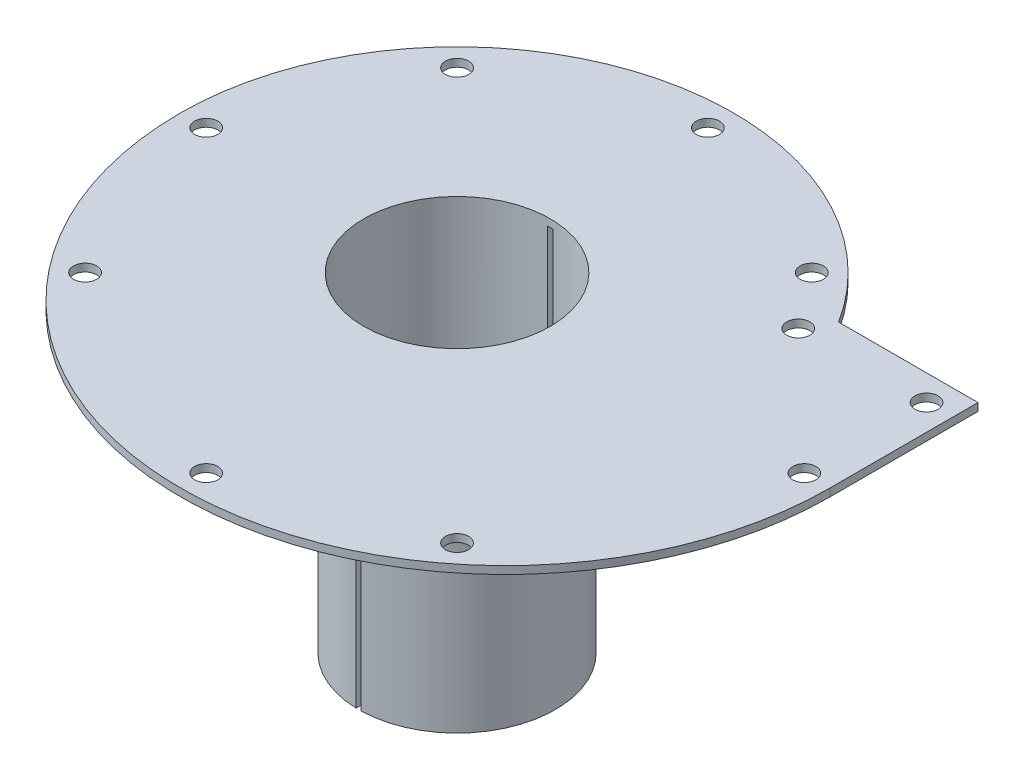
ISO-10303-21;
HEADER;
FILE_DESCRIPTION(('STEP AP214'),'2;1');
FILE_NAME('part.step','',(''),(''),'','','');
FILE_SCHEMA(('AUTOMOTIVE_DESIGN { 1 0 10303 214 1 1 1 1 }'));
ENDSEC;
DATA;
#1=APPLICATION_CONTEXT('core data for automotive mechanical design processes');
#2=APPLICATION_PROTOCOL_DEFINITION('international standard','automotive_design',2000,#1);
#3=PRODUCT_CONTEXT('',#1,'mechanical');
#4=PRODUCT('Part','Part','',(#3));
#5=PRODUCT_RELATED_PRODUCT_CATEGORY('part','',(#4));
#6=PRODUCT_DEFINITION_FORMATION('','',#4);
#7=PRODUCT_DEFINITION_CONTEXT('part definition',#1,'design');
#8=PRODUCT_DEFINITION('design','',#6,#7);
#9=PRODUCT_DEFINITION_SHAPE('','',#8);
#10=(LENGTH_UNIT() NAMED_UNIT(*) SI_UNIT(.MILLI.,.METRE.));
#11=(NAMED_UNIT(*) PLANE_ANGLE_UNIT() SI_UNIT($,.RADIAN.));
#12=(NAMED_UNIT(*) SI_UNIT($,.STERADIAN.) SOLID_ANGLE_UNIT());
#13=UNCERTAINTY_MEASURE_WITH_UNIT(LENGTH_MEASURE(1.E-05),#10,'distance_accuracy_value','');
#14=(GEOMETRIC_REPRESENTATION_CONTEXT(3) GLOBAL_UNCERTAINTY_ASSIGNED_CONTEXT((#13)) GLOBAL_UNIT_ASSIGNED_CONTEXT((#10,
#11,#12)) REPRESENTATION_CONTEXT('',''));
#15=CARTESIAN_POINT('',(0.,0.,0.));
#16=DIRECTION('',(0.,0.,1.));
#17=DIRECTION('',(1.,0.,0.));
#18=AXIS2_PLACEMENT_3D('',#15,#16,#17);
#19=CARTESIAN_POINT('',(0.,-50.,0.));
#20=DIRECTION('',(0.,1.,0.));
#21=DIRECTION('',(0.,0.,1.));
#22=AXIS2_PLACEMENT_3D('',#19,#20,#21);
#23=CYLINDRICAL_SURFACE('',#22,15.3);
#24=DIRECTION('',(0.,1.,0.));
#25=VECTOR('',#24,1.);
#26=CARTESIAN_POINT('',(0.4,-50.,-15.2947703480634));
#27=LINE('',#26,#25);
#28=CARTESIAN_POINT('',(0.4,0.,-15.2947703480634));
#29=VERTEX_POINT('',#28);
#30=CARTESIAN_POINT('',(0.4,-50.,-15.2947703480634));
#31=VERTEX_POINT('',#30);
#32=EDGE_CURVE('E130',#29,#31,#27,.F.);
#33=ORIENTED_EDGE('',*,*,#32,.F.);
#34=CARTESIAN_POINT('',(0.,0.,0.));
#35=DIRECTION('',(0.,1.,0.));
#36=DIRECTION('',(1.,0.,0.));
#37=AXIS2_PLACEMENT_3D('',#34,#35,#36);
#38=CIRCLE('',#37,15.3);
#39=CARTESIAN_POINT('',(0.4,0.,15.2947703480634));
#40=VERTEX_POINT('',#39);
#41=EDGE_CURVE('E158',#40,#29,#38,.T.);
#42=ORIENTED_EDGE('',*,*,#41,.F.);
#43=DIRECTION('',(0.,1.,0.));
#44=VECTOR('',#43,1.);
#45=CARTESIAN_POINT('',(0.4,-50.,15.2947703480634));
#46=LINE('',#45,#44);
#47=CARTESIAN_POINT('',(0.4,-50.,15.2947703480634));
#48=VERTEX_POINT('',#47);
#49=EDGE_CURVE('E139',#48,#40,#46,.T.);
#50=ORIENTED_EDGE('',*,*,#49,.F.);
#51=CARTESIAN_POINT('',(0.,-50.,0.));
#52=DIRECTION('',(0.,1.,0.));
#53=DIRECTION('',(1.,0.,0.));
#54=AXIS2_PLACEMENT_3D('',#51,#52,#53);
#55=CIRCLE('',#54,15.3);
#56=EDGE_CURVE('E146',#48,#31,#55,.T.);
#57=ORIENTED_EDGE('',*,*,#56,.T.);
#58=EDGE_LOOP('',(#33,#42,#50,#57));
#59=FACE_BOUND('',#58,.T.);
#60=ADVANCED_FACE('F43',(#59),#23,.T.);
#61=CARTESIAN_POINT('',(0.,-50.,0.));
#62=DIRECTION('',(0.,1.,0.));
#63=DIRECTION('',(0.,0.,1.));
#64=AXIS2_PLACEMENT_3D('',#61,#62,#63);
#65=PLANE('',#64);
#66=ORIENTED_EDGE('',*,*,#56,.F.);
#67=DIRECTION('',(0.,0.,1.));
#68=VECTOR('',#67,1.);
#69=CARTESIAN_POINT('',(0.4,-50.,17.5));
#70=LINE('',#69,#68);
#71=CARTESIAN_POINT('',(0.4,-50.,14.4944817085676));
#72=VERTEX_POINT('',#71);
#73=EDGE_CURVE('E150',#72,#48,#70,.T.);
#74=ORIENTED_EDGE('',*,*,#73,.F.);
#75=CARTESIAN_POINT('',(0.,-50.,0.));
#76=DIRECTION('',(0.,1.,0.));
#77=DIRECTION('',(0.,0.,1.));
#78=AXIS2_PLACEMENT_3D('',#75,#76,#77);
#79=CIRCLE('',#78,14.5);
#80=CARTESIAN_POINT('',(0.4,-50.,-14.4944817085676));
#81=VERTEX_POINT('',#80);
#82=EDGE_CURVE('E148',#72,#81,#79,.T.);
#83=ORIENTED_EDGE('',*,*,#82,.T.);
#84=EDGE_CURVE('E133',#31,#81,#70,.T.);
#85=ORIENTED_EDGE('',*,*,#84,.F.);
#86=EDGE_LOOP('',(#66,#74,#83,#85));
#87=FACE_BOUND('',#86,.T.);
#88=ADVANCED_FACE('F144',(#87),#65,.F.);
#89=CARTESIAN_POINT('',(0.,1.2,0.));
#90=DIRECTION('',(0.,1.,0.));
#91=DIRECTION('',(0.,0.,1.));
#92=AXIS2_PLACEMENT_3D('',#89,#90,#91);
#93=PLANE('',#92);
#94=CARTESIAN_POINT('',(27.5771644662549,1.2,-27.5771644662958));
#95=DIRECTION('',(0.,1.,0.));
#96=DIRECTION('',(0.,0.,1.));
#97=AXIS2_PLACEMENT_3D('',#94,#95,#96);
#98=CIRCLE('',#97,1.8);
#99=CARTESIAN_POINT('',(27.5771644662549,1.2,-25.7771644662958));
#100=VERTEX_POINT('',#99);
#101=EDGE_CURVE('E272',#100,#100,#98,.T.);
#102=ORIENTED_EDGE('',*,*,#101,.F.);
#103=EDGE_LOOP('',(#102));
#104=FACE_BOUND('',#103,.T.);
#105=CARTESIAN_POINT('',(-28.9159226105549,1.2,28.9159226105978));
#106=DIRECTION('',(0.,1.,0.));
#107=DIRECTION('',(0.,0.,1.));
#108=AXIS2_PLACEMENT_3D('',#105,#106,#107);
#109=CIRCLE('',#108,1.8);
#110=CARTESIAN_POINT('',(-28.9159226105549,1.2,30.7159226105978));
#111=VERTEX_POINT('',#110);
#112=EDGE_CURVE('E260',#111,#111,#109,.T.);
#113=ORIENTED_EDGE('',*,*,#112,.F.);
#114=EDGE_LOOP('',(#113));
#115=FACE_BOUND('',#114,.T.);
#116=CARTESIAN_POINT('',(-1.36167772214882E-13,1.2,-39.));
#117=DIRECTION('',(0.,1.,0.));
#118=DIRECTION('',(0.,0.,1.));
#119=AXIS2_PLACEMENT_3D('',#116,#117,#118);
#120=CIRCLE('',#119,1.8);
#121=CARTESIAN_POINT('',(-1.36167772214882E-13,1.2,-37.2));
#122=VERTEX_POINT('',#121);
#123=EDGE_CURVE('E248',#122,#122,#120,.T.);
#124=ORIENTED_EDGE('',*,*,#123,.F.);
#125=EDGE_LOOP('',(#124));
#126=FACE_BOUND('',#125,.T.);
#127=CARTESIAN_POINT('',(7.49999999999999,1.2,46.5));
#128=DIRECTION('',(0.,1.,0.));
#129=DIRECTION('',(0.,0.,1.));
#130=AXIS2_PLACEMENT_3D('',#127,#128,#129);
#131=CIRCLE('',#130,1.8);
#132=CARTESIAN_POINT('',(7.49999999999999,1.2,48.3));
#133=VERTEX_POINT('',#132);
#134=EDGE_CURVE('E236',#133,#133,#131,.T.);
#135=ORIENTED_EDGE('',*,*,#134,.F.);
#136=EDGE_LOOP('',(#135));
#137=FACE_BOUND('',#136,.T.);
#138=CARTESIAN_POINT('',(54.,1.2,-19.));
#139=DIRECTION('',(0.,1.,0.));
#140=DIRECTION('',(0.,0.,1.));
#141=AXIS2_PLACEMENT_3D('',#138,#139,#140);
#142=CIRCLE('',#141,1.8);
#143=CARTESIAN_POINT('',(54.,1.2,-17.2));
#144=VERTEX_POINT('',#143);
#145=EDGE_CURVE('E224',#144,#144,#142,.T.);
#146=ORIENTED_EDGE('',*,*,#145,.F.);
#147=EDGE_LOOP('',(#146));
#148=FACE_BOUND('',#147,.T.);
#149=CARTESIAN_POINT('',(0.,1.2,0.));
#150=DIRECTION('',(0.,1.,0.));
#151=DIRECTION('',(0.,0.,1.));
#152=AXIS2_PLACEMENT_3D('',#149,#150,#151);
#153=CIRCLE('',#152,43.);
#154=CARTESIAN_POINT('',(36.3318042491699,1.2,-23.));
#155=VERTEX_POINT('',#154);
#156=CARTESIAN_POINT('',(-43.,1.2,0.));
#157=VERTEX_POINT('',#156);
#158=EDGE_CURVE('E206',#155,#157,#153,.T.);
#159=ORIENTED_EDGE('',*,*,#158,.T.);
#160=CARTESIAN_POINT('',(7.5,1.2,0.));
#161=DIRECTION('',(0.,1.,0.));
#162=DIRECTION('',(0.,0.,-1.));
#163=AXIS2_PLACEMENT_3D('',#160,#161,#162);
#164=CIRCLE('',#163,50.5);
#165=CARTESIAN_POINT('',(58.,1.2,0.));
#166=VERTEX_POINT('',#165);
#167=EDGE_CURVE('E217',#157,#166,#164,.T.);
#168=ORIENTED_EDGE('',*,*,#167,.T.);
#169=DIRECTION('',(0.,0.,-1.));
#170=VECTOR('',#169,1.);
#171=CARTESIAN_POINT('',(58.,1.2,-23.));
#172=LINE('',#171,#170);
#173=CARTESIAN_POINT('',(58.,1.2,-23.));
#174=VERTEX_POINT('',#173);
#175=EDGE_CURVE('E215',#166,#174,#172,.T.);
#176=ORIENTED_EDGE('',*,*,#175,.T.);
#177=DIRECTION('',(-1.,0.,0.));
#178=VECTOR('',#177,1.);
#179=CARTESIAN_POINT('',(36.3318042491699,1.2,-23.));
#180=LINE('',#179,#178);
#181=EDGE_CURVE('E203',#174,#155,#180,.T.);
#182=ORIENTED_EDGE('',*,*,#181,.T.);
#183=EDGE_LOOP('',(#159,#168,#176,#182));
#184=FACE_BOUND('',#183,.T.);
#185=CARTESIAN_POINT('',(34.0587727318528,1.2,-19.));
#186=DIRECTION('',(0.,1.,0.));
#187=DIRECTION('',(0.,0.,1.));
#188=AXIS2_PLACEMENT_3D('',#185,#186,#187);
#189=CIRCLE('',#188,1.8);
#190=CARTESIAN_POINT('',(34.0587727318528,1.2,-17.2));
#191=VERTEX_POINT('',#190);
#192=EDGE_CURVE('E213',#191,#191,#189,.T.);
#193=ORIENTED_EDGE('',*,*,#192,.F.);
#194=EDGE_LOOP('',(#193));
#195=FACE_BOUND('',#194,.T.);
#196=CARTESIAN_POINT('',(54.,1.2,0.));
#197=DIRECTION('',(0.,1.,0.));
#198=DIRECTION('',(0.,0.,1.));
#199=AXIS2_PLACEMENT_3D('',#196,#197,#198);
#200=CIRCLE('',#199,1.79999999999999);
#201=CARTESIAN_POINT('',(54.,1.2,1.79999999999999));
#202=VERTEX_POINT('',#201);
#203=EDGE_CURVE('E230',#202,#202,#200,.T.);
#204=ORIENTED_EDGE('',*,*,#203,.F.);
#205=EDGE_LOOP('',(#204));
#206=FACE_BOUND('',#205,.T.);
#207=CARTESIAN_POINT('',(-39.,1.2,0.));
#208=DIRECTION('',(0.,1.,0.));
#209=DIRECTION('',(0.,0.,1.));
#210=AXIS2_PLACEMENT_3D('',#207,#208,#209);
#211=CIRCLE('',#210,1.8);
#212=CARTESIAN_POINT('',(-39.,1.2,1.8));
#213=VERTEX_POINT('',#212);
#214=EDGE_CURVE('E242',#213,#213,#211,.T.);
#215=ORIENTED_EDGE('',*,*,#214,.F.);
#216=EDGE_LOOP('',(#215));
#217=FACE_BOUND('',#216,.T.);
#218=CARTESIAN_POINT('',(36.415922610604,1.2,36.4159226105499));
#219=DIRECTION('',(0.,1.,0.));
#220=DIRECTION('',(0.,0.,1.));
#221=AXIS2_PLACEMENT_3D('',#218,#219,#220);
#222=CIRCLE('',#221,1.79999999996534);
#223=CARTESIAN_POINT('',(36.415922610604,1.2,38.2159226105153));
#224=VERTEX_POINT('',#223);
#225=EDGE_CURVE('E254',#224,#224,#222,.T.);
#226=ORIENTED_EDGE('',*,*,#225,.F.);
#227=EDGE_LOOP('',(#226));
#228=FACE_BOUND('',#227,.T.);
#229=CARTESIAN_POINT('',(-27.5771644662958,1.2,-27.5771644662549));
#230=DIRECTION('',(0.,1.,0.));
#231=DIRECTION('',(0.,0.,1.));
#232=AXIS2_PLACEMENT_3D('',#229,#230,#231);
#233=CIRCLE('',#232,1.8);
#234=CARTESIAN_POINT('',(-27.5771644662958,1.2,-25.7771644662549));
#235=VERTEX_POINT('',#234);
#236=EDGE_CURVE('E266',#235,#235,#233,.T.);
#237=ORIENTED_EDGE('',*,*,#236,.F.);
#238=EDGE_LOOP('',(#237));
#239=FACE_BOUND('',#238,.T.);
#240=CARTESIAN_POINT('',(0.,1.2,0.));
#241=DIRECTION('',(0.,1.,0.));
#242=DIRECTION('',(0.,0.,1.));
#243=AXIS2_PLACEMENT_3D('',#240,#241,#242);
#244=CIRCLE('',#243,14.5);
#245=CARTESIAN_POINT('',(0.,1.2,14.5));
#246=VERTEX_POINT('',#245);
#247=EDGE_CURVE('E138',#246,#246,#244,.T.);
#248=ORIENTED_EDGE('',*,*,#247,.F.);
#249=EDGE_LOOP('',(#248));
#250=FACE_BOUND('',#249,.T.);
#251=ADVANCED_FACE('F313',(#104,#115,#126,#137,#148,#184,#195,#206,#217,#228,#239,#250),#93,.T.);
#252=CARTESIAN_POINT('',(0.,0.,0.));
#253=DIRECTION('',(0.,1.,0.));
#254=DIRECTION('',(0.,0.,1.));
#255=AXIS2_PLACEMENT_3D('',#252,#253,#254);
#256=PLANE('',#255);
#257=DIRECTION('',(0.,0.,-1.));
#258=VECTOR('',#257,1.);
#259=CARTESIAN_POINT('',(0.4,0.,17.5));
#260=LINE('',#259,#258);
#261=CARTESIAN_POINT('',(0.4,0.,14.4944817085676));
#262=VERTEX_POINT('',#261);
#263=EDGE_CURVE('E177',#40,#262,#260,.T.);
#264=ORIENTED_EDGE('',*,*,#263,.F.);
#265=ORIENTED_EDGE('',*,*,#41,.T.);
#266=CARTESIAN_POINT('',(0.4,0.,-14.4944817085676));
#267=VERTEX_POINT('',#266);
#268=EDGE_CURVE('E65',#267,#29,#260,.T.);
#269=ORIENTED_EDGE('',*,*,#268,.F.);
#270=CARTESIAN_POINT('',(0.,0.,0.));
#271=DIRECTION('',(0.,-1.,0.));
#272=DIRECTION('',(0.,0.,-1.));
#273=AXIS2_PLACEMENT_3D('',#270,#271,#272);
#274=CIRCLE('',#273,14.5);
#275=CARTESIAN_POINT('',(-0.4,0.,-14.4944817085676));
#276=VERTEX_POINT('',#275);
#277=EDGE_CURVE('E157',#267,#276,#274,.F.);
#278=ORIENTED_EDGE('',*,*,#277,.T.);
#279=DIRECTION('',(0.,0.,1.));
#280=VECTOR('',#279,1.);
#281=CARTESIAN_POINT('',(-0.4,0.,17.5));
#282=LINE('',#281,#280);
#283=CARTESIAN_POINT('',(-0.4,0.,-15.2947703480634));
#284=VERTEX_POINT('',#283);
#285=EDGE_CURVE('E286',#284,#276,#282,.T.);
#286=ORIENTED_EDGE('',*,*,#285,.F.);
#287=CARTESIAN_POINT('',(-0.4,0.,15.2947703480634));
#288=VERTEX_POINT('',#287);
#289=EDGE_CURVE('E154',#284,#288,#38,.T.);
#290=ORIENTED_EDGE('',*,*,#289,.T.);
#291=CARTESIAN_POINT('',(-0.4,0.,14.4944817085676));
#292=VERTEX_POINT('',#291);
#293=EDGE_CURVE('E58',#292,#288,#282,.T.);
#294=ORIENTED_EDGE('',*,*,#293,.F.);
#295=EDGE_CURVE('E165',#292,#262,#274,.F.);
#296=ORIENTED_EDGE('',*,*,#295,.T.);
#297=EDGE_LOOP('',(#264,#265,#269,#278,#286,#290,#294,#296));
#298=FACE_BOUND('',#297,.T.);
#299=CARTESIAN_POINT('',(-27.5771644662958,0.,-27.5771644662549));
#300=DIRECTION('',(0.,1.,0.));
#301=DIRECTION('',(0.,0.,1.));
#302=AXIS2_PLACEMENT_3D('',#299,#300,#301);
#303=CIRCLE('',#302,1.8);
#304=CARTESIAN_POINT('',(-27.5771644662958,0.,-25.7771644662549));
#305=VERTEX_POINT('',#304);
#306=EDGE_CURVE('E269',#305,#305,#303,.T.);
#307=ORIENTED_EDGE('',*,*,#306,.T.);
#308=EDGE_LOOP('',(#307));
#309=FACE_BOUND('',#308,.T.);
#310=CARTESIAN_POINT('',(36.415922610604,0.,36.4159226105499));
#311=DIRECTION('',(0.,1.,0.));
#312=DIRECTION('',(0.,0.,1.));
#313=AXIS2_PLACEMENT_3D('',#310,#311,#312);
#314=CIRCLE('',#313,1.79999999996534);
#315=CARTESIAN_POINT('',(36.415922610604,0.,38.2159226105153));
#316=VERTEX_POINT('',#315);
#317=EDGE_CURVE('E257',#316,#316,#314,.T.);
#318=ORIENTED_EDGE('',*,*,#317,.T.);
#319=EDGE_LOOP('',(#318));
#320=FACE_BOUND('',#319,.T.);
#321=CARTESIAN_POINT('',(-39.,0.,0.));
#322=DIRECTION('',(0.,1.,0.));
#323=DIRECTION('',(0.,0.,1.));
#324=AXIS2_PLACEMENT_3D('',#321,#322,#323);
#325=CIRCLE('',#324,1.8);
#326=CARTESIAN_POINT('',(-39.,0.,1.8));
#327=VERTEX_POINT('',#326);
#328=EDGE_CURVE('E245',#327,#327,#325,.T.);
#329=ORIENTED_EDGE('',*,*,#328,.T.);
#330=EDGE_LOOP('',(#329));
#331=FACE_BOUND('',#330,.T.);
#332=CARTESIAN_POINT('',(54.,0.,0.));
#333=DIRECTION('',(0.,1.,0.));
#334=DIRECTION('',(0.,0.,1.));
#335=AXIS2_PLACEMENT_3D('',#332,#333,#334);
#336=CIRCLE('',#335,1.79999999999999);
#337=CARTESIAN_POINT('',(54.,0.,1.79999999999999));
#338=VERTEX_POINT('',#337);
#339=EDGE_CURVE('E233',#338,#338,#336,.T.);
#340=ORIENTED_EDGE('',*,*,#339,.T.);
#341=EDGE_LOOP('',(#340));
#342=FACE_BOUND('',#341,.T.);
#343=CARTESIAN_POINT('',(34.0587727318528,0.,-19.));
#344=DIRECTION('',(0.,1.,0.));
#345=DIRECTION('',(0.,0.,1.));
#346=AXIS2_PLACEMENT_3D('',#343,#344,#345);
#347=CIRCLE('',#346,1.8);
#348=CARTESIAN_POINT('',(34.0587727318528,0.,-17.2));
#349=VERTEX_POINT('',#348);
#350=EDGE_CURVE('E221',#349,#349,#347,.T.);
#351=ORIENTED_EDGE('',*,*,#350,.T.);
#352=EDGE_LOOP('',(#351));
#353=FACE_BOUND('',#352,.T.);
#354=CARTESIAN_POINT('',(0.,0.,0.));
#355=DIRECTION('',(0.,1.,0.));
#356=DIRECTION('',(0.,0.,1.));
#357=AXIS2_PLACEMENT_3D('',#354,#355,#356);
#358=CIRCLE('',#357,43.);
#359=CARTESIAN_POINT('',(36.3318042491699,0.,-23.));
#360=VERTEX_POINT('',#359);
#361=CARTESIAN_POINT('',(-43.,0.,0.));
#362=VERTEX_POINT('',#361);
#363=EDGE_CURVE('E211',#360,#362,#358,.T.);
#364=ORIENTED_EDGE('',*,*,#363,.F.);
#365=DIRECTION('',(-1.,0.,0.));
#366=VECTOR('',#365,1.);
#367=CARTESIAN_POINT('',(36.3318042491699,0.,-23.));
#368=LINE('',#367,#366);
#369=CARTESIAN_POINT('',(58.,0.,-23.));
#370=VERTEX_POINT('',#369);
#371=EDGE_CURVE('E204',#370,#360,#368,.T.);
#372=ORIENTED_EDGE('',*,*,#371,.F.);
#373=DIRECTION('',(0.,0.,-1.));
#374=VECTOR('',#373,1.);
#375=CARTESIAN_POINT('',(58.,0.,-23.));
#376=LINE('',#375,#374);
#377=CARTESIAN_POINT('',(58.,0.,0.));
#378=VERTEX_POINT('',#377);
#379=EDGE_CURVE('E207',#378,#370,#376,.T.);
#380=ORIENTED_EDGE('',*,*,#379,.F.);
#381=CARTESIAN_POINT('',(7.5,0.,0.));
#382=DIRECTION('',(0.,1.,0.));
#383=DIRECTION('',(0.,0.,-1.));
#384=AXIS2_PLACEMENT_3D('',#381,#382,#383);
#385=CIRCLE('',#384,50.5);
#386=EDGE_CURVE('E209',#362,#378,#385,.T.);
#387=ORIENTED_EDGE('',*,*,#386,.F.);
#388=EDGE_LOOP('',(#364,#372,#380,#387));
#389=FACE_BOUND('',#388,.T.);
#390=CARTESIAN_POINT('',(54.,0.,-19.));
#391=DIRECTION('',(0.,1.,0.));
#392=DIRECTION('',(0.,0.,1.));
#393=AXIS2_PLACEMENT_3D('',#390,#391,#392);
#394=CIRCLE('',#393,1.8);
#395=CARTESIAN_POINT('',(54.,0.,-17.2));
#396=VERTEX_POINT('',#395);
#397=EDGE_CURVE('E227',#396,#396,#394,.T.);
#398=ORIENTED_EDGE('',*,*,#397,.T.);
#399=EDGE_LOOP('',(#398));
#400=FACE_BOUND('',#399,.T.);
#401=CARTESIAN_POINT('',(7.49999999999999,0.,46.5));
#402=DIRECTION('',(0.,1.,0.));
#403=DIRECTION('',(0.,0.,1.));
#404=AXIS2_PLACEMENT_3D('',#401,#402,#403);
#405=CIRCLE('',#404,1.8);
#406=CARTESIAN_POINT('',(7.49999999999999,0.,48.3));
#407=VERTEX_POINT('',#406);
#408=EDGE_CURVE('E239',#407,#407,#405,.T.);
#409=ORIENTED_EDGE('',*,*,#408,.T.);
#410=EDGE_LOOP('',(#409));
#411=FACE_BOUND('',#410,.T.);
#412=CARTESIAN_POINT('',(-1.36167772214882E-13,0.,-39.));
#413=DIRECTION('',(0.,1.,0.));
#414=DIRECTION('',(0.,0.,1.));
#415=AXIS2_PLACEMENT_3D('',#412,#413,#414);
#416=CIRCLE('',#415,1.8);
#417=CARTESIAN_POINT('',(-1.36167772214882E-13,0.,-37.2));
#418=VERTEX_POINT('',#417);
#419=EDGE_CURVE('E251',#418,#418,#416,.T.);
#420=ORIENTED_EDGE('',*,*,#419,.T.);
#421=EDGE_LOOP('',(#420));
#422=FACE_BOUND('',#421,.T.);
#423=CARTESIAN_POINT('',(-28.9159226105549,0.,28.9159226105978));
#424=DIRECTION('',(0.,1.,0.));
#425=DIRECTION('',(0.,0.,1.));
#426=AXIS2_PLACEMENT_3D('',#423,#424,#425);
#427=CIRCLE('',#426,1.8);
#428=CARTESIAN_POINT('',(-28.9159226105549,0.,30.7159226105978));
#429=VERTEX_POINT('',#428);
#430=EDGE_CURVE('E263',#429,#429,#427,.T.);
#431=ORIENTED_EDGE('',*,*,#430,.T.);
#432=EDGE_LOOP('',(#431));
#433=FACE_BOUND('',#432,.T.);
#434=CARTESIAN_POINT('',(27.5771644662549,0.,-27.5771644662958));
#435=DIRECTION('',(0.,1.,0.));
#436=DIRECTION('',(0.,0.,1.));
#437=AXIS2_PLACEMENT_3D('',#434,#435,#436);
#438=CIRCLE('',#437,1.8);
#439=CARTESIAN_POINT('',(27.5771644662549,0.,-25.7771644662958));
#440=VERTEX_POINT('',#439);
#441=EDGE_CURVE('E275',#440,#440,#438,.T.);
#442=ORIENTED_EDGE('',*,*,#441,.T.);
#443=EDGE_LOOP('',(#442));
#444=FACE_BOUND('',#443,.T.);
#445=ADVANCED_FACE('F45',(#298,#309,#320,#331,#342,#353,#389,#400,#411,#422,#433,#444),#256,.F.);
#446=DIRECTION('',(0.,1.,0.));
#447=VECTOR('',#446,1.);
#448=CARTESIAN_POINT('',(-0.4,-50.,15.2947703480634));
#449=LINE('',#448,#447);
#450=CARTESIAN_POINT('',(-0.4,-50.,15.2947703480634));
#451=VERTEX_POINT('',#450);
#452=EDGE_CURVE('E283',#288,#451,#449,.F.);
#453=ORIENTED_EDGE('',*,*,#452,.F.);
#454=ORIENTED_EDGE('',*,*,#289,.F.);
#455=DIRECTION('',(0.,1.,0.));
#456=VECTOR('',#455,1.);
#457=CARTESIAN_POINT('',(-0.4,-50.,-15.2947703480634));
#458=LINE('',#457,#456);
#459=CARTESIAN_POINT('',(-0.4,-50.,-15.2947703480634));
#460=VERTEX_POINT('',#459);
#461=EDGE_CURVE('E149',#460,#284,#458,.T.);
#462=ORIENTED_EDGE('',*,*,#461,.F.);
#463=EDGE_CURVE('E153',#460,#451,#55,.T.);
#464=ORIENTED_EDGE('',*,*,#463,.T.);
#465=EDGE_LOOP('',(#453,#454,#462,#464));
#466=FACE_BOUND('',#465,.T.);
#467=ADVANCED_FACE('F298',(#466),#23,.T.);
#468=ORIENTED_EDGE('',*,*,#463,.F.);
#469=DIRECTION('',(0.,0.,-1.));
#470=VECTOR('',#469,1.);
#471=CARTESIAN_POINT('',(-0.4,-50.,17.5));
#472=LINE('',#471,#470);
#473=CARTESIAN_POINT('',(-0.4,-50.,-14.4944817085676));
#474=VERTEX_POINT('',#473);
#475=EDGE_CURVE('E289',#474,#460,#472,.T.);
#476=ORIENTED_EDGE('',*,*,#475,.F.);
#477=CARTESIAN_POINT('',(-0.4,-50.,14.4944817085676));
#478=VERTEX_POINT('',#477);
#479=EDGE_CURVE('E184',#474,#478,#79,.T.);
#480=ORIENTED_EDGE('',*,*,#479,.T.);
#481=EDGE_CURVE('E288',#451,#478,#472,.T.);
#482=ORIENTED_EDGE('',*,*,#481,.F.);
#483=EDGE_LOOP('',(#468,#476,#480,#482));
#484=FACE_BOUND('',#483,.T.);
#485=ADVANCED_FACE('F302',(#484),#65,.F.);
#486=CARTESIAN_POINT('',(0.,-50.,0.));
#487=DIRECTION('',(0.,1.,0.));
#488=DIRECTION('',(0.,0.,1.));
#489=AXIS2_PLACEMENT_3D('',#486,#487,#488);
#490=CYLINDRICAL_SURFACE('',#489,14.5);
#491=ORIENTED_EDGE('',*,*,#82,.F.);
#492=DIRECTION('',(0.,1.,0.));
#493=VECTOR('',#492,1.);
#494=CARTESIAN_POINT('',(0.4,-50.,14.4944817085676));
#495=LINE('',#494,#493);
#496=EDGE_CURVE('E12',#72,#262,#495,.T.);
#497=ORIENTED_EDGE('',*,*,#496,.T.);
#498=ORIENTED_EDGE('',*,*,#295,.F.);
#499=DIRECTION('',(0.,1.,0.));
#500=VECTOR('',#499,1.);
#501=CARTESIAN_POINT('',(-0.4,-50.,14.4944817085676));
#502=LINE('',#501,#500);
#503=EDGE_CURVE('E51',#292,#478,#502,.F.);
#504=ORIENTED_EDGE('',*,*,#503,.T.);
#505=ORIENTED_EDGE('',*,*,#479,.F.);
#506=DIRECTION('',(0.,1.,0.));
#507=VECTOR('',#506,1.);
#508=CARTESIAN_POINT('',(-0.4,-50.,-14.4944817085676));
#509=LINE('',#508,#507);
#510=EDGE_CURVE('E164',#474,#276,#509,.T.);
#511=ORIENTED_EDGE('',*,*,#510,.T.);
#512=ORIENTED_EDGE('',*,*,#277,.F.);
#513=DIRECTION('',(0.,1.,0.));
#514=VECTOR('',#513,1.);
#515=CARTESIAN_POINT('',(0.4,-50.,-14.4944817085676));
#516=LINE('',#515,#514);
#517=EDGE_CURVE('E168',#267,#81,#516,.F.);
#518=ORIENTED_EDGE('',*,*,#517,.T.);
#519=EDGE_LOOP('',(#491,#497,#498,#504,#505,#511,#512,#518));
#520=FACE_BOUND('',#519,.T.);
#521=ORIENTED_EDGE('',*,*,#247,.T.);
#522=EDGE_LOOP('',(#521));
#523=FACE_BOUND('',#522,.T.);
#524=ADVANCED_FACE('F181',(#520,#523),#490,.F.);
#525=CARTESIAN_POINT('',(0.,1.2,0.));
#526=DIRECTION('',(0.,-1.,0.));
#527=DIRECTION('',(0.,0.,-1.));
#528=AXIS2_PLACEMENT_3D('',#525,#526,#527);
#529=CYLINDRICAL_SURFACE('',#528,43.);
#530=ORIENTED_EDGE('',*,*,#363,.T.);
#531=DIRECTION('',(0.,-1.,0.));
#532=VECTOR('',#531,1.);
#533=CARTESIAN_POINT('',(-43.,1.2,0.));
#534=LINE('',#533,#532);
#535=EDGE_CURVE('E185',#157,#362,#534,.T.);
#536=ORIENTED_EDGE('',*,*,#535,.F.);
#537=ORIENTED_EDGE('',*,*,#158,.F.);
#538=DIRECTION('',(0.,-1.,0.));
#539=VECTOR('',#538,1.);
#540=CARTESIAN_POINT('',(36.3318042491699,1.2,-23.));
#541=LINE('',#540,#539);
#542=EDGE_CURVE('E200',#155,#360,#541,.T.);
#543=ORIENTED_EDGE('',*,*,#542,.T.);
#544=EDGE_LOOP('',(#530,#536,#537,#543));
#545=FACE_BOUND('',#544,.T.);
#546=ADVANCED_FACE('F309',(#545),#529,.T.);
#547=CARTESIAN_POINT('',(7.5,1.2,0.));
#548=DIRECTION('',(0.,-1.,0.));
#549=DIRECTION('',(0.,0.,-1.));
#550=AXIS2_PLACEMENT_3D('',#547,#548,#549);
#551=CYLINDRICAL_SURFACE('',#550,50.5);
#552=ORIENTED_EDGE('',*,*,#386,.T.);
#553=DIRECTION('',(0.,-1.,0.));
#554=VECTOR('',#553,1.);
#555=CARTESIAN_POINT('',(58.,1.2,0.));
#556=LINE('',#555,#554);
#557=EDGE_CURVE('E190',#166,#378,#556,.T.);
#558=ORIENTED_EDGE('',*,*,#557,.F.);
#559=ORIENTED_EDGE('',*,*,#167,.F.);
#560=ORIENTED_EDGE('',*,*,#535,.T.);
#561=EDGE_LOOP('',(#552,#558,#559,#560));
#562=FACE_BOUND('',#561,.T.);
#563=ADVANCED_FACE('F422',(#562),#551,.T.);
#564=CARTESIAN_POINT('',(58.,1.2,-23.));
#565=DIRECTION('',(-1.,0.,0.));
#566=DIRECTION('',(0.,0.,1.));
#567=AXIS2_PLACEMENT_3D('',#564,#565,#566);
#568=PLANE('',#567);
#569=ORIENTED_EDGE('',*,*,#379,.T.);
#570=DIRECTION('',(0.,-1.,0.));
#571=VECTOR('',#570,1.);
#572=CARTESIAN_POINT('',(58.,1.2,-23.));
#573=LINE('',#572,#571);
#574=EDGE_CURVE('E195',#174,#370,#573,.T.);
#575=ORIENTED_EDGE('',*,*,#574,.F.);
#576=ORIENTED_EDGE('',*,*,#175,.F.);
#577=ORIENTED_EDGE('',*,*,#557,.T.);
#578=EDGE_LOOP('',(#569,#575,#576,#577));
#579=FACE_BOUND('',#578,.T.);
#580=ADVANCED_FACE('F418',(#579),#568,.F.);
#581=CARTESIAN_POINT('',(36.3318042491699,1.2,-23.));
#582=DIRECTION('',(0.,0.,1.));
#583=DIRECTION('',(1.,0.,0.));
#584=AXIS2_PLACEMENT_3D('',#581,#582,#583);
#585=PLANE('',#584);
#586=ORIENTED_EDGE('',*,*,#371,.T.);
#587=ORIENTED_EDGE('',*,*,#542,.F.);
#588=ORIENTED_EDGE('',*,*,#181,.F.);
#589=ORIENTED_EDGE('',*,*,#574,.T.);
#590=EDGE_LOOP('',(#586,#587,#588,#589));
#591=FACE_BOUND('',#590,.T.);
#592=ADVANCED_FACE('F414',(#591),#585,.F.);
#593=CARTESIAN_POINT('',(34.0587727318528,1.2,-19.));
#594=DIRECTION('',(0.,-1.,0.));
#595=DIRECTION('',(0.,0.,-1.));
#596=AXIS2_PLACEMENT_3D('',#593,#594,#595);
#597=CYLINDRICAL_SURFACE('',#596,1.8);
#598=ORIENTED_EDGE('',*,*,#192,.T.);
#599=EDGE_LOOP('',(#598));
#600=FACE_BOUND('',#599,.T.);
#601=ORIENTED_EDGE('',*,*,#350,.F.);
#602=EDGE_LOOP('',(#601));
#603=FACE_BOUND('',#602,.T.);
#604=ADVANCED_FACE('F410',(#600,#603),#597,.F.);
#605=CARTESIAN_POINT('',(54.,1.2,-19.));
#606=DIRECTION('',(0.,-1.,0.));
#607=DIRECTION('',(0.,0.,-1.));
#608=AXIS2_PLACEMENT_3D('',#605,#606,#607);
#609=CYLINDRICAL_SURFACE('',#608,1.8);
#610=ORIENTED_EDGE('',*,*,#145,.T.);
#611=EDGE_LOOP('',(#610));
#612=FACE_BOUND('',#611,.T.);
#613=ORIENTED_EDGE('',*,*,#397,.F.);
#614=EDGE_LOOP('',(#613));
#615=FACE_BOUND('',#614,.T.);
#616=ADVANCED_FACE('F406',(#612,#615),#609,.F.);
#617=CARTESIAN_POINT('',(54.,1.2,0.));
#618=DIRECTION('',(0.,-1.,0.));
#619=DIRECTION('',(0.,0.,-1.));
#620=AXIS2_PLACEMENT_3D('',#617,#618,#619);
#621=CYLINDRICAL_SURFACE('',#620,1.79999999999999);
#622=ORIENTED_EDGE('',*,*,#203,.T.);
#623=EDGE_LOOP('',(#622));
#624=FACE_BOUND('',#623,.T.);
#625=ORIENTED_EDGE('',*,*,#339,.F.);
#626=EDGE_LOOP('',(#625));
#627=FACE_BOUND('',#626,.T.);
#628=ADVANCED_FACE('F402',(#624,#627),#621,.F.);
#629=CARTESIAN_POINT('',(7.49999999999999,1.2,46.5));
#630=DIRECTION('',(0.,-1.,0.));
#631=DIRECTION('',(0.,0.,-1.));
#632=AXIS2_PLACEMENT_3D('',#629,#630,#631);
#633=CYLINDRICAL_SURFACE('',#632,1.8);
#634=ORIENTED_EDGE('',*,*,#134,.T.);
#635=EDGE_LOOP('',(#634));
#636=FACE_BOUND('',#635,.T.);
#637=ORIENTED_EDGE('',*,*,#408,.F.);
#638=EDGE_LOOP('',(#637));
#639=FACE_BOUND('',#638,.T.);
#640=ADVANCED_FACE('F398',(#636,#639),#633,.F.);
#641=CARTESIAN_POINT('',(-39.,1.2,0.));
#642=DIRECTION('',(0.,-1.,0.));
#643=DIRECTION('',(0.,0.,-1.));
#644=AXIS2_PLACEMENT_3D('',#641,#642,#643);
#645=CYLINDRICAL_SURFACE('',#644,1.8);
#646=ORIENTED_EDGE('',*,*,#214,.T.);
#647=EDGE_LOOP('',(#646));
#648=FACE_BOUND('',#647,.T.);
#649=ORIENTED_EDGE('',*,*,#328,.F.);
#650=EDGE_LOOP('',(#649));
#651=FACE_BOUND('',#650,.T.);
#652=ADVANCED_FACE('F394',(#648,#651),#645,.F.);
#653=CARTESIAN_POINT('',(-1.36167772214882E-13,1.2,-39.));
#654=DIRECTION('',(0.,-1.,0.));
#655=DIRECTION('',(0.,0.,-1.));
#656=AXIS2_PLACEMENT_3D('',#653,#654,#655);
#657=CYLINDRICAL_SURFACE('',#656,1.8);
#658=ORIENTED_EDGE('',*,*,#123,.T.);
#659=EDGE_LOOP('',(#658));
#660=FACE_BOUND('',#659,.T.);
#661=ORIENTED_EDGE('',*,*,#419,.F.);
#662=EDGE_LOOP('',(#661));
#663=FACE_BOUND('',#662,.T.);
#664=ADVANCED_FACE('F390',(#660,#663),#657,.F.);
#665=CARTESIAN_POINT('',(36.415922610604,1.2,36.4159226105499));
#666=DIRECTION('',(0.,-1.,0.));
#667=DIRECTION('',(0.,0.,-1.));
#668=AXIS2_PLACEMENT_3D('',#665,#666,#667);
#669=CYLINDRICAL_SURFACE('',#668,1.79999999996534);
#670=ORIENTED_EDGE('',*,*,#225,.T.);
#671=EDGE_LOOP('',(#670));
#672=FACE_BOUND('',#671,.T.);
#673=ORIENTED_EDGE('',*,*,#317,.F.);
#674=EDGE_LOOP('',(#673));
#675=FACE_BOUND('',#674,.T.);
#676=ADVANCED_FACE('F386',(#672,#675),#669,.F.);
#677=CARTESIAN_POINT('',(-28.9159226105549,1.2,28.9159226105978));
#678=DIRECTION('',(0.,-1.,0.));
#679=DIRECTION('',(0.,0.,-1.));
#680=AXIS2_PLACEMENT_3D('',#677,#678,#679);
#681=CYLINDRICAL_SURFACE('',#680,1.8);
#682=ORIENTED_EDGE('',*,*,#112,.T.);
#683=EDGE_LOOP('',(#682));
#684=FACE_BOUND('',#683,.T.);
#685=ORIENTED_EDGE('',*,*,#430,.F.);
#686=EDGE_LOOP('',(#685));
#687=FACE_BOUND('',#686,.T.);
#688=ADVANCED_FACE('F350',(#684,#687),#681,.F.);
#689=CARTESIAN_POINT('',(-27.5771644662958,1.2,-27.5771644662549));
#690=DIRECTION('',(0.,-1.,0.));
#691=DIRECTION('',(0.,0.,-1.));
#692=AXIS2_PLACEMENT_3D('',#689,#690,#691);
#693=CYLINDRICAL_SURFACE('',#692,1.8);
#694=ORIENTED_EDGE('',*,*,#236,.T.);
#695=EDGE_LOOP('',(#694));
#696=FACE_BOUND('',#695,.T.);
#697=ORIENTED_EDGE('',*,*,#306,.F.);
#698=EDGE_LOOP('',(#697));
#699=FACE_BOUND('',#698,.T.);
#700=ADVANCED_FACE('F346',(#696,#699),#693,.F.);
#701=CARTESIAN_POINT('',(27.5771644662549,1.2,-27.5771644662958));
#702=DIRECTION('',(0.,-1.,0.));
#703=DIRECTION('',(0.,0.,-1.));
#704=AXIS2_PLACEMENT_3D('',#701,#702,#703);
#705=CYLINDRICAL_SURFACE('',#704,1.8);
#706=ORIENTED_EDGE('',*,*,#101,.T.);
#707=EDGE_LOOP('',(#706));
#708=FACE_BOUND('',#707,.T.);
#709=ORIENTED_EDGE('',*,*,#441,.F.);
#710=EDGE_LOOP('',(#709));
#711=FACE_BOUND('',#710,.T.);
#712=ADVANCED_FACE('F349',(#708,#711),#705,.F.);
#713=CARTESIAN_POINT('',(-0.4,-85.0091416632856,17.5));
#714=DIRECTION('',(-1.,0.,0.));
#715=DIRECTION('',(0.,0.,1.));
#716=AXIS2_PLACEMENT_3D('',#713,#714,#715);
#717=PLANE('',#716);
#718=ORIENTED_EDGE('',*,*,#461,.T.);
#719=ORIENTED_EDGE('',*,*,#285,.T.);
#720=ORIENTED_EDGE('',*,*,#510,.F.);
#721=ORIENTED_EDGE('',*,*,#475,.T.);
#722=EDGE_LOOP('',(#718,#719,#720,#721));
#723=FACE_BOUND('',#722,.T.);
#724=ADVANCED_FACE('F294',(#723),#717,.F.);
#725=CARTESIAN_POINT('',(0.4,-85.0091416632856,17.5));
#726=DIRECTION('',(1.,0.,0.));
#727=DIRECTION('',(0.,0.,-1.));
#728=AXIS2_PLACEMENT_3D('',#725,#726,#727);
#729=PLANE('',#728);
#730=ORIENTED_EDGE('',*,*,#32,.T.);
#731=ORIENTED_EDGE('',*,*,#84,.T.);
#732=ORIENTED_EDGE('',*,*,#517,.F.);
#733=ORIENTED_EDGE('',*,*,#268,.T.);
#734=EDGE_LOOP('',(#730,#731,#732,#733));
#735=FACE_BOUND('',#734,.T.);
#736=ADVANCED_FACE('F132',(#735),#729,.F.);
#737=ORIENTED_EDGE('',*,*,#49,.T.);
#738=ORIENTED_EDGE('',*,*,#263,.T.);
#739=ORIENTED_EDGE('',*,*,#496,.F.);
#740=ORIENTED_EDGE('',*,*,#73,.T.);
#741=EDGE_LOOP('',(#737,#738,#739,#740));
#742=FACE_BOUND('',#741,.T.);
#743=ADVANCED_FACE('F179',(#742),#729,.F.);
#744=ORIENTED_EDGE('',*,*,#452,.T.);
#745=ORIENTED_EDGE('',*,*,#481,.T.);
#746=ORIENTED_EDGE('',*,*,#503,.F.);
#747=ORIENTED_EDGE('',*,*,#293,.T.);
#748=EDGE_LOOP('',(#744,#745,#746,#747));
#749=FACE_BOUND('',#748,.T.);
#750=ADVANCED_FACE('F301',(#749),#717,.F.);
#751=CLOSED_SHELL('',(#60,#88,#251,#445,#467,#485,#524,#546,#563,#580,#592,#604,#616,#628,#640,
#652,#664,#676,#688,#700,#712,#724,#736,#743,#750));
#752=MANIFOLD_SOLID_BREP('B2',#751);
#753=ADVANCED_BREP_SHAPE_REPRESENTATION('',(#18,#752),#14);
#754=SHAPE_DEFINITION_REPRESENTATION(#9,#753);
ENDSEC;
END-ISO-10303-21;
